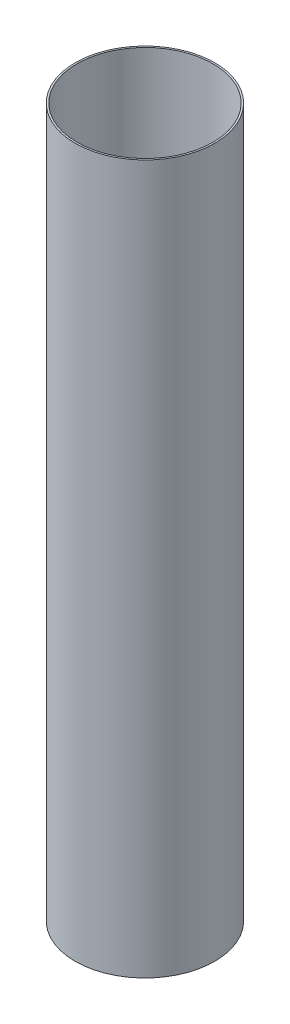
ISO-10303-21;
HEADER;
FILE_DESCRIPTION(('STEP AP214'),'2;1');
FILE_NAME('part.step','',(''),(''),'','','');
FILE_SCHEMA(('AUTOMOTIVE_DESIGN { 1 0 10303 214 1 1 1 1 }'));
ENDSEC;
DATA;
#1=APPLICATION_CONTEXT('core data for automotive mechanical design processes');
#2=APPLICATION_PROTOCOL_DEFINITION('international standard','automotive_design',2000,#1);
#3=PRODUCT_CONTEXT('',#1,'mechanical');
#4=PRODUCT('Part','Part','',(#3));
#5=PRODUCT_RELATED_PRODUCT_CATEGORY('part','',(#4));
#6=PRODUCT_DEFINITION_FORMATION('','',#4);
#7=PRODUCT_DEFINITION_CONTEXT('part definition',#1,'design');
#8=PRODUCT_DEFINITION('design','',#6,#7);
#9=PRODUCT_DEFINITION_SHAPE('','',#8);
#10=(LENGTH_UNIT() NAMED_UNIT(*) SI_UNIT(.MILLI.,.METRE.));
#11=(NAMED_UNIT(*) PLANE_ANGLE_UNIT() SI_UNIT($,.RADIAN.));
#12=(NAMED_UNIT(*) SI_UNIT($,.STERADIAN.) SOLID_ANGLE_UNIT());
#13=UNCERTAINTY_MEASURE_WITH_UNIT(LENGTH_MEASURE(1.E-05),#10,'distance_accuracy_value','');
#14=(GEOMETRIC_REPRESENTATION_CONTEXT(3) GLOBAL_UNCERTAINTY_ASSIGNED_CONTEXT((#13)) GLOBAL_UNIT_ASSIGNED_CONTEXT((#10,
#11,#12)) REPRESENTATION_CONTEXT('',''));
#15=CARTESIAN_POINT('',(0.,0.,0.));
#16=DIRECTION('',(0.,0.,1.));
#17=DIRECTION('',(1.,0.,0.));
#18=AXIS2_PLACEMENT_3D('',#15,#16,#17);
#19=CARTESIAN_POINT('',(0.,203.,0.));
#20=DIRECTION('',(0.,1.,0.));
#21=DIRECTION('',(0.,0.,1.));
#22=AXIS2_PLACEMENT_3D('',#19,#20,#21);
#23=PLANE('',#22);
#24=CARTESIAN_POINT('',(0.,203.,0.));
#25=DIRECTION('',(0.,1.,0.));
#26=DIRECTION('',(0.,0.,1.));
#27=AXIS2_PLACEMENT_3D('',#24,#25,#26);
#28=CIRCLE('',#27,20.);
#29=CARTESIAN_POINT('',(0.,203.,20.));
#30=VERTEX_POINT('',#29);
#31=EDGE_CURVE('E10',#30,#30,#28,.T.);
#32=ORIENTED_EDGE('',*,*,#31,.T.);
#33=EDGE_LOOP('',(#32));
#34=FACE_BOUND('',#33,.T.);
#35=CARTESIAN_POINT('',(0.,203.,0.));
#36=DIRECTION('',(0.,1.,0.));
#37=DIRECTION('',(0.,0.,1.));
#38=AXIS2_PLACEMENT_3D('',#35,#36,#37);
#39=CIRCLE('',#38,19.5);
#40=CARTESIAN_POINT('',(0.,203.,19.5));
#41=VERTEX_POINT('',#40);
#42=EDGE_CURVE('E53',#41,#41,#39,.T.);
#43=ORIENTED_EDGE('',*,*,#42,.F.);
#44=EDGE_LOOP('',(#43));
#45=FACE_BOUND('',#44,.T.);
#46=ADVANCED_FACE('F42',(#34,#45),#23,.T.);
#47=CARTESIAN_POINT('',(0.,0.,0.));
#48=DIRECTION('',(0.,1.,0.));
#49=DIRECTION('',(0.,0.,1.));
#50=AXIS2_PLACEMENT_3D('',#47,#48,#49);
#51=PLANE('',#50);
#52=CARTESIAN_POINT('',(0.,0.,0.));
#53=DIRECTION('',(0.,1.,0.));
#54=DIRECTION('',(0.,0.,1.));
#55=AXIS2_PLACEMENT_3D('',#52,#53,#54);
#56=CIRCLE('',#55,20.);
#57=CARTESIAN_POINT('',(0.,0.,20.));
#58=VERTEX_POINT('',#57);
#59=EDGE_CURVE('E46',#58,#58,#56,.T.);
#60=ORIENTED_EDGE('',*,*,#59,.F.);
#61=EDGE_LOOP('',(#60));
#62=FACE_BOUND('',#61,.T.);
#63=CARTESIAN_POINT('',(0.,0.,0.));
#64=DIRECTION('',(0.,1.,0.));
#65=DIRECTION('',(0.,0.,1.));
#66=AXIS2_PLACEMENT_3D('',#63,#64,#65);
#67=CIRCLE('',#66,19.5);
#68=CARTESIAN_POINT('',(0.,0.,19.5));
#69=VERTEX_POINT('',#68);
#70=EDGE_CURVE('E55',#69,#69,#67,.T.);
#71=ORIENTED_EDGE('',*,*,#70,.T.);
#72=EDGE_LOOP('',(#71));
#73=FACE_BOUND('',#72,.T.);
#74=ADVANCED_FACE('F65',(#62,#73),#51,.F.);
#75=CARTESIAN_POINT('',(0.,203.,0.));
#76=DIRECTION('',(0.,-1.,0.));
#77=DIRECTION('',(0.,0.,-1.));
#78=AXIS2_PLACEMENT_3D('',#75,#76,#77);
#79=CYLINDRICAL_SURFACE('',#78,20.);
#80=ORIENTED_EDGE('',*,*,#31,.F.);
#81=EDGE_LOOP('',(#80));
#82=FACE_BOUND('',#81,.T.);
#83=ORIENTED_EDGE('',*,*,#59,.T.);
#84=EDGE_LOOP('',(#83));
#85=FACE_BOUND('',#84,.T.);
#86=ADVANCED_FACE('F44',(#82,#85),#79,.T.);
#87=CARTESIAN_POINT('',(0.,203.,0.));
#88=DIRECTION('',(0.,-1.,0.));
#89=DIRECTION('',(0.,0.,-1.));
#90=AXIS2_PLACEMENT_3D('',#87,#88,#89);
#91=CYLINDRICAL_SURFACE('',#90,19.5);
#92=ORIENTED_EDGE('',*,*,#42,.T.);
#93=EDGE_LOOP('',(#92));
#94=FACE_BOUND('',#93,.T.);
#95=ORIENTED_EDGE('',*,*,#70,.F.);
#96=EDGE_LOOP('',(#95));
#97=FACE_BOUND('',#96,.T.);
#98=ADVANCED_FACE('F61',(#94,#97),#91,.F.);
#99=CLOSED_SHELL('',(#46,#74,#86,#98));
#100=MANIFOLD_SOLID_BREP('B2',#99);
#101=ADVANCED_BREP_SHAPE_REPRESENTATION('',(#18,#100),#14);
#102=SHAPE_DEFINITION_REPRESENTATION(#9,#101);
ENDSEC;
END-ISO-10303-21;
